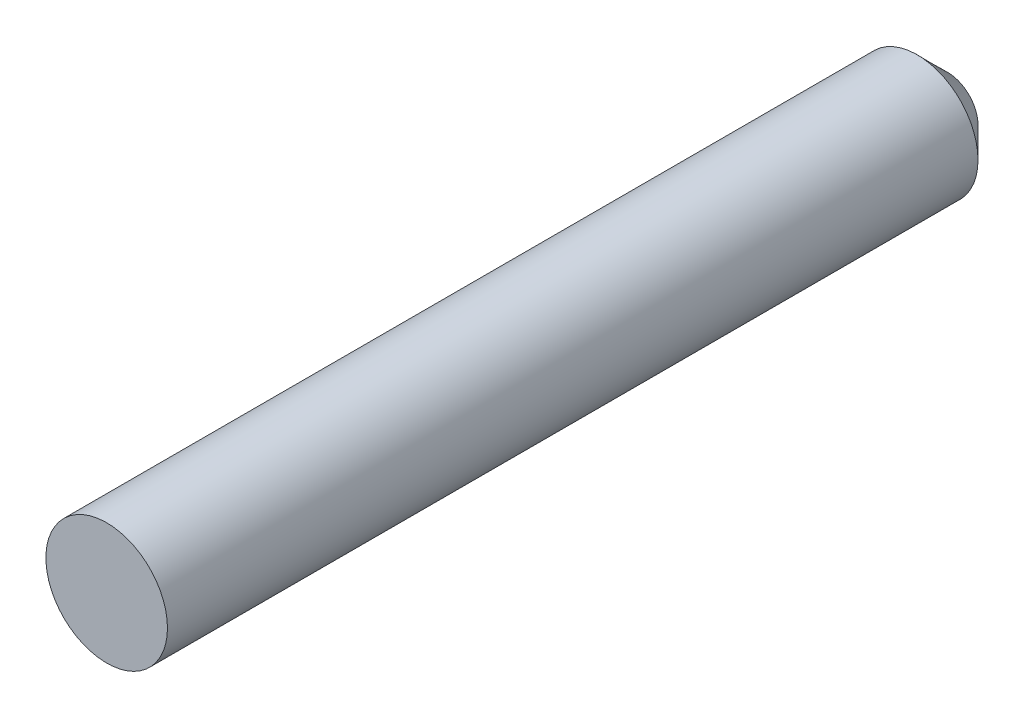
ISO-10303-21;
HEADER;
FILE_DESCRIPTION(('STEP AP214'),'2;1');
FILE_NAME('part.step','',(''),(''),'','','');
FILE_SCHEMA(('AUTOMOTIVE_DESIGN { 1 0 10303 214 1 1 1 1 }'));
ENDSEC;
DATA;
#1=APPLICATION_CONTEXT('core data for automotive mechanical design processes');
#2=APPLICATION_PROTOCOL_DEFINITION('international standard','automotive_design',2000,#1);
#3=PRODUCT_CONTEXT('',#1,'mechanical');
#4=PRODUCT('Part','Part','',(#3));
#5=PRODUCT_RELATED_PRODUCT_CATEGORY('part','',(#4));
#6=PRODUCT_DEFINITION_FORMATION('','',#4);
#7=PRODUCT_DEFINITION_CONTEXT('part definition',#1,'design');
#8=PRODUCT_DEFINITION('design','',#6,#7);
#9=PRODUCT_DEFINITION_SHAPE('','',#8);
#10=(LENGTH_UNIT() NAMED_UNIT(*) SI_UNIT(.MILLI.,.METRE.));
#11=(NAMED_UNIT(*) PLANE_ANGLE_UNIT() SI_UNIT($,.RADIAN.));
#12=(NAMED_UNIT(*) SI_UNIT($,.STERADIAN.) SOLID_ANGLE_UNIT());
#13=UNCERTAINTY_MEASURE_WITH_UNIT(LENGTH_MEASURE(1.E-05),#10,'distance_accuracy_value','');
#14=(GEOMETRIC_REPRESENTATION_CONTEXT(3) GLOBAL_UNCERTAINTY_ASSIGNED_CONTEXT((#13)) GLOBAL_UNIT_ASSIGNED_CONTEXT((#10,
#11,#12)) REPRESENTATION_CONTEXT('',''));
#15=CARTESIAN_POINT('',(0.,0.,0.));
#16=DIRECTION('',(0.,0.,1.));
#17=DIRECTION('',(1.,0.,0.));
#18=AXIS2_PLACEMENT_3D('',#15,#16,#17);
#19=CARTESIAN_POINT('',(0.,0.,83.));
#20=DIRECTION('',(0.,0.,-1.));
#21=DIRECTION('',(-1.,0.,0.));
#22=AXIS2_PLACEMENT_3D('',#19,#20,#21);
#23=CYLINDRICAL_SURFACE('',#22,6.);
#24=CARTESIAN_POINT('',(0.,0.,3.));
#25=DIRECTION('',(0.,0.,1.));
#26=DIRECTION('',(1.,0.,0.));
#27=AXIS2_PLACEMENT_3D('',#24,#25,#26);
#28=CIRCLE('',#27,6.);
#29=CARTESIAN_POINT('',(6.,0.,3.));
#30=VERTEX_POINT('',#29);
#31=EDGE_CURVE('E45',#30,#30,#28,.T.);
#32=ORIENTED_EDGE('',*,*,#31,.T.);
#33=EDGE_LOOP('',(#32));
#34=FACE_BOUND('',#33,.T.);
#35=CARTESIAN_POINT('',(0.,0.,83.));
#36=DIRECTION('',(0.,0.,1.));
#37=DIRECTION('',(1.,0.,0.));
#38=AXIS2_PLACEMENT_3D('',#35,#36,#37);
#39=CIRCLE('',#38,6.);
#40=CARTESIAN_POINT('',(6.,0.,83.));
#41=VERTEX_POINT('',#40);
#42=EDGE_CURVE('E49',#41,#41,#39,.T.);
#43=ORIENTED_EDGE('',*,*,#42,.F.);
#44=EDGE_LOOP('',(#43));
#45=FACE_BOUND('',#44,.T.);
#46=ADVANCED_FACE('F37',(#34,#45),#23,.T.);
#47=CARTESIAN_POINT('',(0.,0.,83.));
#48=DIRECTION('',(0.,0.,1.));
#49=DIRECTION('',(1.,0.,0.));
#50=AXIS2_PLACEMENT_3D('',#47,#48,#49);
#51=PLANE('',#50);
#52=ORIENTED_EDGE('',*,*,#42,.T.);
#53=EDGE_LOOP('',(#52));
#54=FACE_BOUND('',#53,.T.);
#55=ADVANCED_FACE('F56',(#54),#51,.T.);
#56=CARTESIAN_POINT('',(0.,0.,0.));
#57=DIRECTION('',(0.,0.,1.));
#58=DIRECTION('',(1.,0.,0.));
#59=AXIS2_PLACEMENT_3D('',#56,#57,#58);
#60=PLANE('',#59);
#61=CARTESIAN_POINT('',(0.,0.,0.));
#62=DIRECTION('',(0.,0.,1.));
#63=DIRECTION('',(1.,0.,0.));
#64=AXIS2_PLACEMENT_3D('',#61,#62,#63);
#65=CIRCLE('',#64,2.99999999999999);
#66=CARTESIAN_POINT('',(2.99999999999999,0.,0.));
#67=VERTEX_POINT('',#66);
#68=EDGE_CURVE('E10',#67,#67,#65,.F.);
#69=ORIENTED_EDGE('',*,*,#68,.T.);
#70=EDGE_LOOP('',(#69));
#71=FACE_BOUND('',#70,.T.);
#72=ADVANCED_FACE('F62',(#71),#60,.F.);
#73=CARTESIAN_POINT('',(0.,0.,3.));
#74=DIRECTION('',(0.,0.,1.));
#75=DIRECTION('',(1.,0.,0.));
#76=AXIS2_PLACEMENT_3D('',#73,#74,#75);
#77=CONICAL_SURFACE('',#76,6.,0.78539816339745);
#78=ORIENTED_EDGE('',*,*,#68,.F.);
#79=EDGE_LOOP('',(#78));
#80=FACE_BOUND('',#79,.T.);
#81=ORIENTED_EDGE('',*,*,#31,.F.);
#82=EDGE_LOOP('',(#81));
#83=FACE_BOUND('',#82,.T.);
#84=ADVANCED_FACE('F40',(#80,#83),#77,.T.);
#85=CLOSED_SHELL('',(#46,#55,#72,#84));
#86=MANIFOLD_SOLID_BREP('B2',#85);
#87=ADVANCED_BREP_SHAPE_REPRESENTATION('',(#18,#86),#14);
#88=SHAPE_DEFINITION_REPRESENTATION(#9,#87);
ENDSEC;
END-ISO-10303-21;
